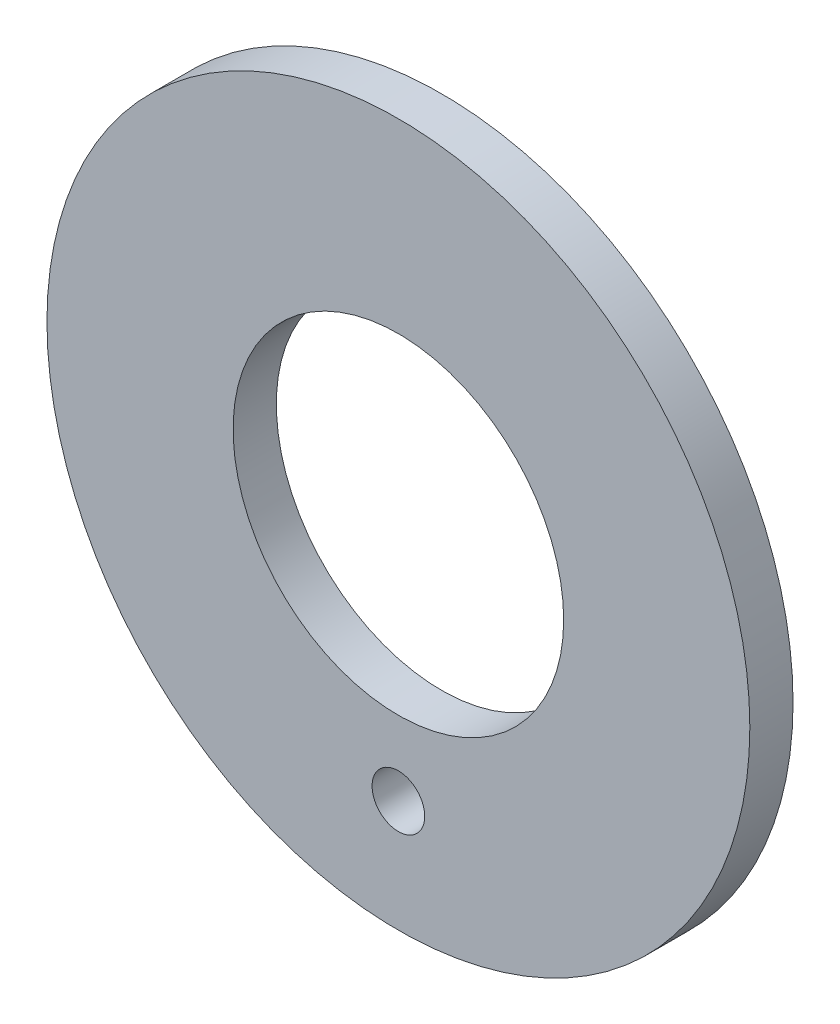
ISO-10303-21;
HEADER;
FILE_DESCRIPTION(('STEP AP214'),'2;1');
FILE_NAME('part.step','',(''),(''),'','','');
FILE_SCHEMA(('AUTOMOTIVE_DESIGN { 1 0 10303 214 1 1 1 1 }'));
ENDSEC;
DATA;
#1=APPLICATION_CONTEXT('core data for automotive mechanical design processes');
#2=APPLICATION_PROTOCOL_DEFINITION('international standard','automotive_design',2000,#1);
#3=PRODUCT_CONTEXT('',#1,'mechanical');
#4=PRODUCT('Part','Part','',(#3));
#5=PRODUCT_RELATED_PRODUCT_CATEGORY('part','',(#4));
#6=PRODUCT_DEFINITION_FORMATION('','',#4);
#7=PRODUCT_DEFINITION_CONTEXT('part definition',#1,'design');
#8=PRODUCT_DEFINITION('design','',#6,#7);
#9=PRODUCT_DEFINITION_SHAPE('','',#8);
#10=(LENGTH_UNIT() NAMED_UNIT(*) SI_UNIT(.MILLI.,.METRE.));
#11=(NAMED_UNIT(*) PLANE_ANGLE_UNIT() SI_UNIT($,.RADIAN.));
#12=(NAMED_UNIT(*) SI_UNIT($,.STERADIAN.) SOLID_ANGLE_UNIT());
#13=UNCERTAINTY_MEASURE_WITH_UNIT(LENGTH_MEASURE(1.E-05),#10,'distance_accuracy_value','');
#14=(GEOMETRIC_REPRESENTATION_CONTEXT(3) GLOBAL_UNCERTAINTY_ASSIGNED_CONTEXT((#13)) GLOBAL_UNIT_ASSIGNED_CONTEXT((#10,
#11,#12)) REPRESENTATION_CONTEXT('',''));
#15=CARTESIAN_POINT('',(0.,0.,0.));
#16=DIRECTION('',(0.,0.,1.));
#17=DIRECTION('',(1.,0.,0.));
#18=AXIS2_PLACEMENT_3D('',#15,#16,#17);
#19=CARTESIAN_POINT('',(0.,0.,1.374));
#20=DIRECTION('',(0.,0.,1.));
#21=DIRECTION('',(1.,0.,0.));
#22=AXIS2_PLACEMENT_3D('',#19,#20,#21);
#23=PLANE('',#22);
#24=CARTESIAN_POINT('',(0.,0.,1.374));
#25=DIRECTION('',(0.,0.,1.));
#26=DIRECTION('',(1.,0.,0.));
#27=AXIS2_PLACEMENT_3D('',#24,#25,#26);
#28=CIRCLE('',#27,5.2562);
#29=CARTESIAN_POINT('',(5.2562,0.,1.374));
#30=VERTEX_POINT('',#29);
#31=EDGE_CURVE('E49',#30,#30,#28,.T.);
#32=ORIENTED_EDGE('',*,*,#31,.F.);
#33=EDGE_LOOP('',(#32));
#34=FACE_BOUND('',#33,.T.);
#35=CARTESIAN_POINT('',(0.,0.,1.374));
#36=DIRECTION('',(0.,0.,1.));
#37=DIRECTION('',(1.,0.,0.));
#38=AXIS2_PLACEMENT_3D('',#35,#36,#37);
#39=CIRCLE('',#38,11.176);
#40=CARTESIAN_POINT('',(11.176,0.,1.374));
#41=VERTEX_POINT('',#40);
#42=EDGE_CURVE('E10',#41,#41,#39,.T.);
#43=ORIENTED_EDGE('',*,*,#42,.T.);
#44=EDGE_LOOP('',(#43));
#45=FACE_BOUND('',#44,.T.);
#46=CARTESIAN_POINT('',(0.,-7.62,1.374));
#47=DIRECTION('',(0.,0.,1.));
#48=DIRECTION('',(1.,0.,0.));
#49=AXIS2_PLACEMENT_3D('',#46,#47,#48);
#50=CIRCLE('',#49,0.837);
#51=CARTESIAN_POINT('',(0.837,-7.62,1.374));
#52=VERTEX_POINT('',#51);
#53=EDGE_CURVE('E54',#52,#52,#50,.T.);
#54=ORIENTED_EDGE('',*,*,#53,.F.);
#55=EDGE_LOOP('',(#54));
#56=FACE_BOUND('',#55,.T.);
#57=ADVANCED_FACE('F38',(#34,#45,#56),#23,.T.);
#58=CARTESIAN_POINT('',(0.,0.,0.));
#59=DIRECTION('',(0.,0.,1.));
#60=DIRECTION('',(1.,0.,0.));
#61=AXIS2_PLACEMENT_3D('',#58,#59,#60);
#62=PLANE('',#61);
#63=CARTESIAN_POINT('',(0.,0.,0.));
#64=DIRECTION('',(0.,0.,1.));
#65=DIRECTION('',(1.,0.,0.));
#66=AXIS2_PLACEMENT_3D('',#63,#64,#65);
#67=CIRCLE('',#66,11.176);
#68=CARTESIAN_POINT('',(11.176,0.,0.));
#69=VERTEX_POINT('',#68);
#70=EDGE_CURVE('E42',#69,#69,#67,.T.);
#71=ORIENTED_EDGE('',*,*,#70,.F.);
#72=EDGE_LOOP('',(#71));
#73=FACE_BOUND('',#72,.T.);
#74=CARTESIAN_POINT('',(0.,0.,0.));
#75=DIRECTION('',(0.,0.,1.));
#76=DIRECTION('',(1.,0.,0.));
#77=AXIS2_PLACEMENT_3D('',#74,#75,#76);
#78=CIRCLE('',#77,5.2562);
#79=CARTESIAN_POINT('',(5.2562,0.,0.));
#80=VERTEX_POINT('',#79);
#81=EDGE_CURVE('E51',#80,#80,#78,.T.);
#82=ORIENTED_EDGE('',*,*,#81,.T.);
#83=EDGE_LOOP('',(#82));
#84=FACE_BOUND('',#83,.T.);
#85=CARTESIAN_POINT('',(0.,-7.62,0.));
#86=DIRECTION('',(0.,0.,1.));
#87=DIRECTION('',(1.,0.,0.));
#88=AXIS2_PLACEMENT_3D('',#85,#86,#87);
#89=CIRCLE('',#88,0.837);
#90=CARTESIAN_POINT('',(0.837,-7.62,0.));
#91=VERTEX_POINT('',#90);
#92=EDGE_CURVE('E57',#91,#91,#89,.T.);
#93=ORIENTED_EDGE('',*,*,#92,.T.);
#94=EDGE_LOOP('',(#93));
#95=FACE_BOUND('',#94,.T.);
#96=ADVANCED_FACE('F67',(#73,#84,#95),#62,.F.);
#97=CARTESIAN_POINT('',(0.,0.,1.374));
#98=DIRECTION('',(0.,0.,-1.));
#99=DIRECTION('',(-1.,0.,0.));
#100=AXIS2_PLACEMENT_3D('',#97,#98,#99);
#101=CYLINDRICAL_SURFACE('',#100,11.176);
#102=ORIENTED_EDGE('',*,*,#42,.F.);
#103=EDGE_LOOP('',(#102));
#104=FACE_BOUND('',#103,.T.);
#105=ORIENTED_EDGE('',*,*,#70,.T.);
#106=EDGE_LOOP('',(#105));
#107=FACE_BOUND('',#106,.T.);
#108=ADVANCED_FACE('F40',(#104,#107),#101,.T.);
#109=CARTESIAN_POINT('',(0.,0.,1.374));
#110=DIRECTION('',(0.,0.,-1.));
#111=DIRECTION('',(-1.,0.,0.));
#112=AXIS2_PLACEMENT_3D('',#109,#110,#111);
#113=CYLINDRICAL_SURFACE('',#112,5.2562);
#114=ORIENTED_EDGE('',*,*,#31,.T.);
#115=EDGE_LOOP('',(#114));
#116=FACE_BOUND('',#115,.T.);
#117=ORIENTED_EDGE('',*,*,#81,.F.);
#118=EDGE_LOOP('',(#117));
#119=FACE_BOUND('',#118,.T.);
#120=ADVANCED_FACE('F76',(#116,#119),#113,.F.);
#121=CARTESIAN_POINT('',(0.,-7.62,1.374));
#122=DIRECTION('',(0.,0.,-1.));
#123=DIRECTION('',(-1.,0.,0.));
#124=AXIS2_PLACEMENT_3D('',#121,#122,#123);
#125=CYLINDRICAL_SURFACE('',#124,0.837);
#126=ORIENTED_EDGE('',*,*,#53,.T.);
#127=EDGE_LOOP('',(#126));
#128=FACE_BOUND('',#127,.T.);
#129=ORIENTED_EDGE('',*,*,#92,.F.);
#130=EDGE_LOOP('',(#129));
#131=FACE_BOUND('',#130,.T.);
#132=ADVANCED_FACE('F63',(#128,#131),#125,.F.);
#133=CLOSED_SHELL('',(#57,#96,#108,#120,#132));
#134=MANIFOLD_SOLID_BREP('B2',#133);
#135=ADVANCED_BREP_SHAPE_REPRESENTATION('',(#18,#134),#14);
#136=SHAPE_DEFINITION_REPRESENTATION(#9,#135);
ENDSEC;
END-ISO-10303-21;
